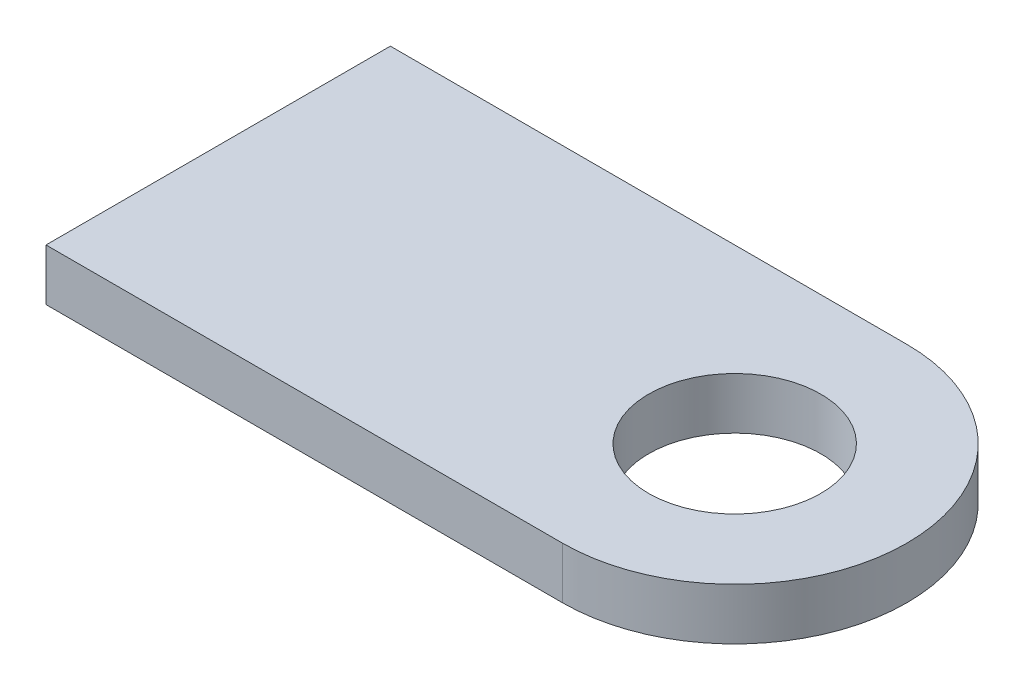
ISO-10303-21;
HEADER;
FILE_DESCRIPTION(('STEP AP214'),'2;1');
FILE_NAME('part.step','',(''),(''),'','','');
FILE_SCHEMA(('AUTOMOTIVE_DESIGN { 1 0 10303 214 1 1 1 1 }'));
ENDSEC;
DATA;
#1=APPLICATION_CONTEXT('core data for automotive mechanical design processes');
#2=APPLICATION_PROTOCOL_DEFINITION('international standard','automotive_design',2000,#1);
#3=PRODUCT_CONTEXT('',#1,'mechanical');
#4=PRODUCT('Part','Part','',(#3));
#5=PRODUCT_RELATED_PRODUCT_CATEGORY('part','',(#4));
#6=PRODUCT_DEFINITION_FORMATION('','',#4);
#7=PRODUCT_DEFINITION_CONTEXT('part definition',#1,'design');
#8=PRODUCT_DEFINITION('design','',#6,#7);
#9=PRODUCT_DEFINITION_SHAPE('','',#8);
#10=(LENGTH_UNIT() NAMED_UNIT(*) SI_UNIT(.MILLI.,.METRE.));
#11=(NAMED_UNIT(*) PLANE_ANGLE_UNIT() SI_UNIT($,.RADIAN.));
#12=(NAMED_UNIT(*) SI_UNIT($,.STERADIAN.) SOLID_ANGLE_UNIT());
#13=UNCERTAINTY_MEASURE_WITH_UNIT(LENGTH_MEASURE(1.E-05),#10,'distance_accuracy_value','');
#14=(GEOMETRIC_REPRESENTATION_CONTEXT(3) GLOBAL_UNCERTAINTY_ASSIGNED_CONTEXT((#13)) GLOBAL_UNIT_ASSIGNED_CONTEXT((#10,
#11,#12)) REPRESENTATION_CONTEXT('',''));
#15=CARTESIAN_POINT('',(0.,0.,0.));
#16=DIRECTION('',(0.,0.,1.));
#17=DIRECTION('',(1.,0.,0.));
#18=AXIS2_PLACEMENT_3D('',#15,#16,#17);
#19=CARTESIAN_POINT('',(30.,3.,-10.));
#20=DIRECTION('',(0.,-1.,0.));
#21=DIRECTION('',(0.,0.,-1.));
#22=AXIS2_PLACEMENT_3D('',#19,#20,#21);
#23=PLANE('',#22);
#24=DIRECTION('',(0.,0.,1.));
#25=VECTOR('',#24,1.);
#26=CARTESIAN_POINT('',(0.,3.,0.));
#27=LINE('',#26,#25);
#28=CARTESIAN_POINT('',(0.,3.,-20.));
#29=VERTEX_POINT('',#28);
#30=CARTESIAN_POINT('',(0.,3.,0.));
#31=VERTEX_POINT('',#30);
#32=EDGE_CURVE('E88',#29,#31,#27,.T.);
#33=ORIENTED_EDGE('',*,*,#32,.T.);
#34=DIRECTION('',(1.,0.,0.));
#35=VECTOR('',#34,1.);
#36=CARTESIAN_POINT('',(0.,3.,0.));
#37=LINE('',#36,#35);
#38=CARTESIAN_POINT('',(30.,3.,0.));
#39=VERTEX_POINT('',#38);
#40=EDGE_CURVE('E83',#31,#39,#37,.T.);
#41=ORIENTED_EDGE('',*,*,#40,.T.);
#42=CARTESIAN_POINT('',(30.,3.,-10.));
#43=DIRECTION('',(0.,1.,0.));
#44=DIRECTION('',(0.,0.,-1.));
#45=AXIS2_PLACEMENT_3D('',#42,#43,#44);
#46=CIRCLE('',#45,10.);
#47=CARTESIAN_POINT('',(30.,3.,-20.));
#48=VERTEX_POINT('',#47);
#49=EDGE_CURVE('E86',#39,#48,#46,.T.);
#50=ORIENTED_EDGE('',*,*,#49,.T.);
#51=DIRECTION('',(-1.,0.,0.));
#52=VECTOR('',#51,1.);
#53=CARTESIAN_POINT('',(0.,3.,-20.));
#54=LINE('',#53,#52);
#55=EDGE_CURVE('E53',#48,#29,#54,.T.);
#56=ORIENTED_EDGE('',*,*,#55,.T.);
#57=EDGE_LOOP('',(#33,#41,#50,#56));
#58=FACE_BOUND('',#57,.T.);
#59=CARTESIAN_POINT('',(30.,3.,-10.));
#60=DIRECTION('',(0.,1.,0.));
#61=DIRECTION('',(0.,0.,1.));
#62=AXIS2_PLACEMENT_3D('',#59,#60,#61);
#63=CIRCLE('',#62,5.);
#64=CARTESIAN_POINT('',(30.,3.,-5.));
#65=VERTEX_POINT('',#64);
#66=EDGE_CURVE('E103',#65,#65,#63,.T.);
#67=ORIENTED_EDGE('',*,*,#66,.F.);
#68=EDGE_LOOP('',(#67));
#69=FACE_BOUND('',#68,.T.);
#70=ADVANCED_FACE('F36',(#58,#69),#23,.F.);
#71=CARTESIAN_POINT('',(30.,0.,-10.));
#72=DIRECTION('',(0.,-1.,0.));
#73=DIRECTION('',(0.,0.,-1.));
#74=AXIS2_PLACEMENT_3D('',#71,#72,#73);
#75=PLANE('',#74);
#76=DIRECTION('',(0.,0.,1.));
#77=VECTOR('',#76,1.);
#78=CARTESIAN_POINT('',(0.,0.,0.));
#79=LINE('',#78,#77);
#80=CARTESIAN_POINT('',(0.,0.,-20.));
#81=VERTEX_POINT('',#80);
#82=CARTESIAN_POINT('',(0.,0.,0.));
#83=VERTEX_POINT('',#82);
#84=EDGE_CURVE('E100',#81,#83,#79,.T.);
#85=ORIENTED_EDGE('',*,*,#84,.F.);
#86=DIRECTION('',(-1.,0.,0.));
#87=VECTOR('',#86,1.);
#88=CARTESIAN_POINT('',(0.,0.,-20.));
#89=LINE('',#88,#87);
#90=CARTESIAN_POINT('',(30.,0.,-20.));
#91=VERTEX_POINT('',#90);
#92=EDGE_CURVE('E76',#91,#81,#89,.T.);
#93=ORIENTED_EDGE('',*,*,#92,.F.);
#94=CARTESIAN_POINT('',(30.,0.,-10.));
#95=DIRECTION('',(0.,1.,0.));
#96=DIRECTION('',(0.,0.,-1.));
#97=AXIS2_PLACEMENT_3D('',#94,#95,#96);
#98=CIRCLE('',#97,10.);
#99=CARTESIAN_POINT('',(30.,0.,0.));
#100=VERTEX_POINT('',#99);
#101=EDGE_CURVE('E70',#100,#91,#98,.T.);
#102=ORIENTED_EDGE('',*,*,#101,.F.);
#103=DIRECTION('',(1.,0.,0.));
#104=VECTOR('',#103,1.);
#105=CARTESIAN_POINT('',(0.,0.,0.));
#106=LINE('',#105,#104);
#107=EDGE_CURVE('E92',#83,#100,#106,.T.);
#108=ORIENTED_EDGE('',*,*,#107,.F.);
#109=EDGE_LOOP('',(#85,#93,#102,#108));
#110=FACE_BOUND('',#109,.T.);
#111=CARTESIAN_POINT('',(30.,0.,-10.));
#112=DIRECTION('',(0.,1.,0.));
#113=DIRECTION('',(0.,0.,1.));
#114=AXIS2_PLACEMENT_3D('',#111,#112,#113);
#115=CIRCLE('',#114,5.);
#116=CARTESIAN_POINT('',(30.,0.,-5.));
#117=VERTEX_POINT('',#116);
#118=EDGE_CURVE('E115',#117,#117,#115,.T.);
#119=ORIENTED_EDGE('',*,*,#118,.T.);
#120=EDGE_LOOP('',(#119));
#121=FACE_BOUND('',#120,.T.);
#122=ADVANCED_FACE('F111',(#110,#121),#75,.T.);
#123=CARTESIAN_POINT('',(0.,3.,0.));
#124=DIRECTION('',(1.,0.,0.));
#125=DIRECTION('',(0.,0.,-1.));
#126=AXIS2_PLACEMENT_3D('',#123,#124,#125);
#127=PLANE('',#126);
#128=ORIENTED_EDGE('',*,*,#84,.T.);
#129=DIRECTION('',(0.,-1.,0.));
#130=VECTOR('',#129,1.);
#131=CARTESIAN_POINT('',(0.,3.,0.));
#132=LINE('',#131,#130);
#133=EDGE_CURVE('E11',#31,#83,#132,.T.);
#134=ORIENTED_EDGE('',*,*,#133,.F.);
#135=ORIENTED_EDGE('',*,*,#32,.F.);
#136=DIRECTION('',(0.,-1.,0.));
#137=VECTOR('',#136,1.);
#138=CARTESIAN_POINT('',(0.,3.,-20.));
#139=LINE('',#138,#137);
#140=EDGE_CURVE('E96',#29,#81,#139,.T.);
#141=ORIENTED_EDGE('',*,*,#140,.T.);
#142=EDGE_LOOP('',(#128,#134,#135,#141));
#143=FACE_BOUND('',#142,.T.);
#144=ADVANCED_FACE('F38',(#143),#127,.F.);
#145=CARTESIAN_POINT('',(0.,3.,0.));
#146=DIRECTION('',(0.,0.,-1.));
#147=DIRECTION('',(-1.,0.,0.));
#148=AXIS2_PLACEMENT_3D('',#145,#146,#147);
#149=PLANE('',#148);
#150=ORIENTED_EDGE('',*,*,#107,.T.);
#151=DIRECTION('',(0.,-1.,0.));
#152=VECTOR('',#151,1.);
#153=CARTESIAN_POINT('',(30.,3.,0.));
#154=LINE('',#153,#152);
#155=EDGE_CURVE('E45',#39,#100,#154,.T.);
#156=ORIENTED_EDGE('',*,*,#155,.F.);
#157=ORIENTED_EDGE('',*,*,#40,.F.);
#158=ORIENTED_EDGE('',*,*,#133,.T.);
#159=EDGE_LOOP('',(#150,#156,#157,#158));
#160=FACE_BOUND('',#159,.T.);
#161=ADVANCED_FACE('F91',(#160),#149,.F.);
#162=CARTESIAN_POINT('',(30.,3.,-10.));
#163=DIRECTION('',(0.,-1.,0.));
#164=DIRECTION('',(0.,0.,-1.));
#165=AXIS2_PLACEMENT_3D('',#162,#163,#164);
#166=CYLINDRICAL_SURFACE('',#165,10.);
#167=ORIENTED_EDGE('',*,*,#101,.T.);
#168=DIRECTION('',(0.,-1.,0.));
#169=VECTOR('',#168,1.);
#170=CARTESIAN_POINT('',(30.,3.,-20.));
#171=LINE('',#170,#169);
#172=EDGE_CURVE('E93',#48,#91,#171,.T.);
#173=ORIENTED_EDGE('',*,*,#172,.F.);
#174=ORIENTED_EDGE('',*,*,#49,.F.);
#175=ORIENTED_EDGE('',*,*,#155,.T.);
#176=EDGE_LOOP('',(#167,#173,#174,#175));
#177=FACE_BOUND('',#176,.T.);
#178=ADVANCED_FACE('F94',(#177),#166,.T.);
#179=CARTESIAN_POINT('',(0.,3.,-20.));
#180=DIRECTION('',(0.,0.,1.));
#181=DIRECTION('',(1.,0.,0.));
#182=AXIS2_PLACEMENT_3D('',#179,#180,#181);
#183=PLANE('',#182);
#184=ORIENTED_EDGE('',*,*,#92,.T.);
#185=ORIENTED_EDGE('',*,*,#140,.F.);
#186=ORIENTED_EDGE('',*,*,#55,.F.);
#187=ORIENTED_EDGE('',*,*,#172,.T.);
#188=EDGE_LOOP('',(#184,#185,#186,#187));
#189=FACE_BOUND('',#188,.T.);
#190=ADVANCED_FACE('F108',(#189),#183,.F.);
#191=CARTESIAN_POINT('',(30.,3.,-10.));
#192=DIRECTION('',(0.,-1.,0.));
#193=DIRECTION('',(0.,0.,-1.));
#194=AXIS2_PLACEMENT_3D('',#191,#192,#193);
#195=CYLINDRICAL_SURFACE('',#194,5.);
#196=ORIENTED_EDGE('',*,*,#66,.T.);
#197=EDGE_LOOP('',(#196));
#198=FACE_BOUND('',#197,.T.);
#199=ORIENTED_EDGE('',*,*,#118,.F.);
#200=EDGE_LOOP('',(#199));
#201=FACE_BOUND('',#200,.T.);
#202=ADVANCED_FACE('F121',(#198,#201),#195,.F.);
#203=CLOSED_SHELL('',(#70,#122,#144,#161,#178,#190,#202));
#204=MANIFOLD_SOLID_BREP('B2',#203);
#205=ADVANCED_BREP_SHAPE_REPRESENTATION('',(#18,#204),#14);
#206=SHAPE_DEFINITION_REPRESENTATION(#9,#205);
ENDSEC;
END-ISO-10303-21;
